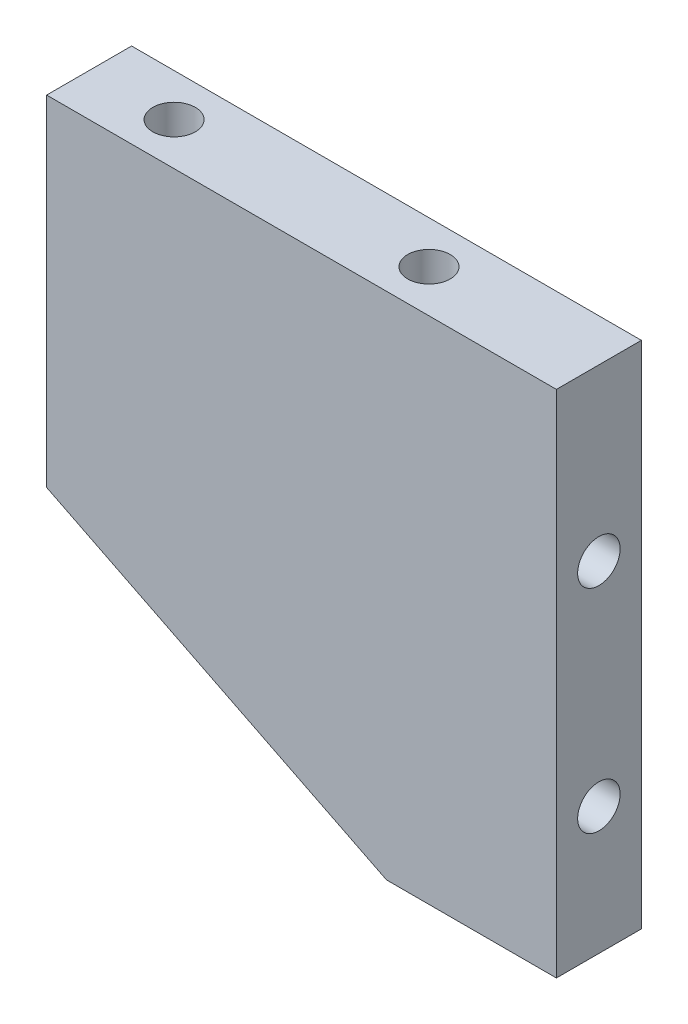
ISO-10303-21;
HEADER;
FILE_DESCRIPTION(('STEP AP214'),'2;1');
FILE_NAME('part.step','',(''),(''),'','','');
FILE_SCHEMA(('AUTOMOTIVE_DESIGN { 1 0 10303 214 1 1 1 1 }'));
ENDSEC;
DATA;
#1=APPLICATION_CONTEXT('core data for automotive mechanical design processes');
#2=APPLICATION_PROTOCOL_DEFINITION('international standard','automotive_design',2000,#1);
#3=PRODUCT_CONTEXT('',#1,'mechanical');
#4=PRODUCT('Part','Part','',(#3));
#5=PRODUCT_RELATED_PRODUCT_CATEGORY('part','',(#4));
#6=PRODUCT_DEFINITION_FORMATION('','',#4);
#7=PRODUCT_DEFINITION_CONTEXT('part definition',#1,'design');
#8=PRODUCT_DEFINITION('design','',#6,#7);
#9=PRODUCT_DEFINITION_SHAPE('','',#8);
#10=(LENGTH_UNIT() NAMED_UNIT(*) SI_UNIT(.MILLI.,.METRE.));
#11=(NAMED_UNIT(*) PLANE_ANGLE_UNIT() SI_UNIT($,.RADIAN.));
#12=(NAMED_UNIT(*) SI_UNIT($,.STERADIAN.) SOLID_ANGLE_UNIT());
#13=UNCERTAINTY_MEASURE_WITH_UNIT(LENGTH_MEASURE(1.E-05),#10,'distance_accuracy_value','');
#14=(GEOMETRIC_REPRESENTATION_CONTEXT(3) GLOBAL_UNCERTAINTY_ASSIGNED_CONTEXT((#13)) GLOBAL_UNIT_ASSIGNED_CONTEXT((#10,
#11,#12)) REPRESENTATION_CONTEXT('',''));
#15=CARTESIAN_POINT('',(0.,0.,0.));
#16=DIRECTION('',(0.,0.,1.));
#17=DIRECTION('',(1.,0.,0.));
#18=AXIS2_PLACEMENT_3D('',#15,#16,#17);
#19=CARTESIAN_POINT('',(0.,-60.,5.));
#20=DIRECTION('',(-1.,0.,0.));
#21=DIRECTION('',(0.,0.,1.));
#22=AXIS2_PLACEMENT_3D('',#19,#20,#21);
#23=PLANE('',#22);
#24=CARTESIAN_POINT('',(0.,-20.,0.));
#25=DIRECTION('',(1.,0.,0.));
#26=DIRECTION('',(0.,0.,-1.));
#27=AXIS2_PLACEMENT_3D('',#24,#25,#26);
#28=CIRCLE('',#27,2.49999999999999);
#29=CARTESIAN_POINT('',(0.,-20.,-2.49999999999999));
#30=VERTEX_POINT('',#29);
#31=EDGE_CURVE('E152',#30,#30,#28,.T.);
#32=ORIENTED_EDGE('',*,*,#31,.F.);
#33=EDGE_LOOP('',(#32));
#34=FACE_BOUND('',#33,.T.);
#35=CARTESIAN_POINT('',(0.,-45.,0.));
#36=DIRECTION('',(1.,0.,0.));
#37=DIRECTION('',(0.,0.,-1.));
#38=AXIS2_PLACEMENT_3D('',#35,#36,#37);
#39=CIRCLE('',#38,2.49999999999999);
#40=CARTESIAN_POINT('',(0.,-45.,-2.49999999999999));
#41=VERTEX_POINT('',#40);
#42=EDGE_CURVE('E155',#41,#41,#39,.T.);
#43=ORIENTED_EDGE('',*,*,#42,.F.);
#44=EDGE_LOOP('',(#43));
#45=FACE_BOUND('',#44,.T.);
#46=DIRECTION('',(0.,1.,0.));
#47=VECTOR('',#46,1.);
#48=CARTESIAN_POINT('',(0.,-60.,-5.));
#49=LINE('',#48,#47);
#50=CARTESIAN_POINT('',(0.,-60.,-5.));
#51=VERTEX_POINT('',#50);
#52=CARTESIAN_POINT('',(0.,0.,-5.));
#53=VERTEX_POINT('',#52);
#54=EDGE_CURVE('E115',#51,#53,#49,.T.);
#55=ORIENTED_EDGE('',*,*,#54,.T.);
#56=DIRECTION('',(0.,0.,-1.));
#57=VECTOR('',#56,1.);
#58=CARTESIAN_POINT('',(0.,0.,5.));
#59=LINE('',#58,#57);
#60=CARTESIAN_POINT('',(0.,0.,5.));
#61=VERTEX_POINT('',#60);
#62=EDGE_CURVE('E11',#61,#53,#59,.T.);
#63=ORIENTED_EDGE('',*,*,#62,.F.);
#64=DIRECTION('',(0.,1.,0.));
#65=VECTOR('',#64,1.);
#66=CARTESIAN_POINT('',(0.,-60.,5.));
#67=LINE('',#66,#65);
#68=CARTESIAN_POINT('',(0.,-60.,5.));
#69=VERTEX_POINT('',#68);
#70=EDGE_CURVE('E124',#69,#61,#67,.T.);
#71=ORIENTED_EDGE('',*,*,#70,.F.);
#72=DIRECTION('',(0.,0.,-1.));
#73=VECTOR('',#72,1.);
#74=CARTESIAN_POINT('',(0.,-60.,5.));
#75=LINE('',#74,#73);
#76=EDGE_CURVE('E111',#69,#51,#75,.T.);
#77=ORIENTED_EDGE('',*,*,#76,.T.);
#78=EDGE_LOOP('',(#55,#63,#71,#77));
#79=FACE_BOUND('',#78,.T.);
#80=ADVANCED_FACE('F38',(#34,#45,#79),#23,.F.);
#81=CARTESIAN_POINT('',(0.,0.,5.));
#82=DIRECTION('',(0.,-1.,0.));
#83=DIRECTION('',(1.,0.,0.));
#84=AXIS2_PLACEMENT_3D('',#81,#82,#83);
#85=PLANE('',#84);
#86=CARTESIAN_POINT('',(-20.,0.,0.));
#87=DIRECTION('',(0.,1.,0.));
#88=DIRECTION('',(0.,0.,1.));
#89=AXIS2_PLACEMENT_3D('',#86,#87,#88);
#90=CIRCLE('',#89,2.49999999999999);
#91=CARTESIAN_POINT('',(-20.,0.,2.49999999999999));
#92=VERTEX_POINT('',#91);
#93=EDGE_CURVE('E175',#92,#92,#90,.T.);
#94=ORIENTED_EDGE('',*,*,#93,.F.);
#95=EDGE_LOOP('',(#94));
#96=FACE_BOUND('',#95,.T.);
#97=CARTESIAN_POINT('',(-50.,0.,0.));
#98=DIRECTION('',(0.,1.,0.));
#99=DIRECTION('',(0.,0.,1.));
#100=AXIS2_PLACEMENT_3D('',#97,#98,#99);
#101=CIRCLE('',#100,2.49999999999999);
#102=CARTESIAN_POINT('',(-50.,0.,2.49999999999999));
#103=VERTEX_POINT('',#102);
#104=EDGE_CURVE('E169',#103,#103,#101,.T.);
#105=ORIENTED_EDGE('',*,*,#104,.F.);
#106=EDGE_LOOP('',(#105));
#107=FACE_BOUND('',#106,.T.);
#108=DIRECTION('',(-1.,0.,0.));
#109=VECTOR('',#108,1.);
#110=CARTESIAN_POINT('',(0.,0.,-5.));
#111=LINE('',#110,#109);
#112=CARTESIAN_POINT('',(-60.,0.,-5.));
#113=VERTEX_POINT('',#112);
#114=EDGE_CURVE('E118',#53,#113,#111,.T.);
#115=ORIENTED_EDGE('',*,*,#114,.T.);
#116=DIRECTION('',(0.,0.,-1.));
#117=VECTOR('',#116,1.);
#118=CARTESIAN_POINT('',(-60.,0.,5.));
#119=LINE('',#118,#117);
#120=CARTESIAN_POINT('',(-60.,0.,5.));
#121=VERTEX_POINT('',#120);
#122=EDGE_CURVE('E46',#121,#113,#119,.T.);
#123=ORIENTED_EDGE('',*,*,#122,.F.);
#124=DIRECTION('',(-1.,0.,0.));
#125=VECTOR('',#124,1.);
#126=CARTESIAN_POINT('',(0.,0.,5.));
#127=LINE('',#126,#125);
#128=EDGE_CURVE('E89',#61,#121,#127,.T.);
#129=ORIENTED_EDGE('',*,*,#128,.F.);
#130=ORIENTED_EDGE('',*,*,#62,.T.);
#131=EDGE_LOOP('',(#115,#123,#129,#130));
#132=FACE_BOUND('',#131,.T.);
#133=ADVANCED_FACE('F143',(#96,#107,#132),#85,.F.);
#134=CARTESIAN_POINT('',(-60.,0.,5.));
#135=DIRECTION('',(1.,0.,0.));
#136=DIRECTION('',(0.,1.,0.));
#137=AXIS2_PLACEMENT_3D('',#134,#135,#136);
#138=PLANE('',#137);
#139=DIRECTION('',(0.,-1.,0.));
#140=VECTOR('',#139,1.);
#141=CARTESIAN_POINT('',(-60.,0.,-5.));
#142=LINE('',#141,#140);
#143=CARTESIAN_POINT('',(-60.,-40.,-5.));
#144=VERTEX_POINT('',#143);
#145=EDGE_CURVE('E106',#113,#144,#142,.T.);
#146=ORIENTED_EDGE('',*,*,#145,.T.);
#147=DIRECTION('',(0.,0.,-1.));
#148=VECTOR('',#147,1.);
#149=CARTESIAN_POINT('',(-60.,-40.,5.));
#150=LINE('',#149,#148);
#151=CARTESIAN_POINT('',(-60.,-40.,5.));
#152=VERTEX_POINT('',#151);
#153=EDGE_CURVE('E103',#152,#144,#150,.T.);
#154=ORIENTED_EDGE('',*,*,#153,.F.);
#155=DIRECTION('',(0.,-1.,0.));
#156=VECTOR('',#155,1.);
#157=CARTESIAN_POINT('',(-60.,0.,5.));
#158=LINE('',#157,#156);
#159=EDGE_CURVE('E95',#121,#152,#158,.T.);
#160=ORIENTED_EDGE('',*,*,#159,.F.);
#161=ORIENTED_EDGE('',*,*,#122,.T.);
#162=EDGE_LOOP('',(#146,#154,#160,#161));
#163=FACE_BOUND('',#162,.T.);
#164=ADVANCED_FACE('F104',(#163),#138,.F.);
#165=CARTESIAN_POINT('',(-60.,-40.,5.));
#166=DIRECTION('',(0.447213595499958,0.894427190999916,0.));
#167=DIRECTION('',(-0.894427190999916,0.447213595499958,0.));
#168=AXIS2_PLACEMENT_3D('',#165,#166,#167);
#169=PLANE('',#168);
#170=DIRECTION('',(0.894427190999916,-0.447213595499958,0.));
#171=VECTOR('',#170,1.);
#172=CARTESIAN_POINT('',(-60.,-40.,-5.));
#173=LINE('',#172,#171);
#174=CARTESIAN_POINT('',(-20.,-60.,-5.));
#175=VERTEX_POINT('',#174);
#176=EDGE_CURVE('E75',#144,#175,#173,.T.);
#177=ORIENTED_EDGE('',*,*,#176,.T.);
#178=DIRECTION('',(0.,0.,-1.));
#179=VECTOR('',#178,1.);
#180=CARTESIAN_POINT('',(-20.,-60.,5.));
#181=LINE('',#180,#179);
#182=CARTESIAN_POINT('',(-20.,-60.,5.));
#183=VERTEX_POINT('',#182);
#184=EDGE_CURVE('E107',#183,#175,#181,.T.);
#185=ORIENTED_EDGE('',*,*,#184,.F.);
#186=DIRECTION('',(0.894427190999916,-0.447213595499958,0.));
#187=VECTOR('',#186,1.);
#188=CARTESIAN_POINT('',(-60.,-40.,5.));
#189=LINE('',#188,#187);
#190=EDGE_CURVE('E99',#152,#183,#189,.T.);
#191=ORIENTED_EDGE('',*,*,#190,.F.);
#192=ORIENTED_EDGE('',*,*,#153,.T.);
#193=EDGE_LOOP('',(#177,#185,#191,#192));
#194=FACE_BOUND('',#193,.T.);
#195=ADVANCED_FACE('F109',(#194),#169,.F.);
#196=CARTESIAN_POINT('',(-20.,-60.,5.));
#197=DIRECTION('',(0.,1.,0.));
#198=DIRECTION('',(0.,0.,1.));
#199=AXIS2_PLACEMENT_3D('',#196,#197,#198);
#200=PLANE('',#199);
#201=DIRECTION('',(1.,0.,0.));
#202=VECTOR('',#201,1.);
#203=CARTESIAN_POINT('',(-20.,-60.,-5.));
#204=LINE('',#203,#202);
#205=EDGE_CURVE('E81',#175,#51,#204,.T.);
#206=ORIENTED_EDGE('',*,*,#205,.T.);
#207=ORIENTED_EDGE('',*,*,#76,.F.);
#208=DIRECTION('',(1.,0.,0.));
#209=VECTOR('',#208,1.);
#210=CARTESIAN_POINT('',(-20.,-60.,5.));
#211=LINE('',#210,#209);
#212=EDGE_CURVE('E54',#183,#69,#211,.T.);
#213=ORIENTED_EDGE('',*,*,#212,.F.);
#214=ORIENTED_EDGE('',*,*,#184,.T.);
#215=EDGE_LOOP('',(#206,#207,#213,#214));
#216=FACE_BOUND('',#215,.T.);
#217=ADVANCED_FACE('F132',(#216),#200,.F.);
#218=CARTESIAN_POINT('',(0.,0.,5.));
#219=DIRECTION('',(0.,0.,1.));
#220=DIRECTION('',(1.,0.,0.));
#221=AXIS2_PLACEMENT_3D('',#218,#219,#220);
#222=PLANE('',#221);
#223=ORIENTED_EDGE('',*,*,#70,.T.);
#224=ORIENTED_EDGE('',*,*,#128,.T.);
#225=ORIENTED_EDGE('',*,*,#159,.T.);
#226=ORIENTED_EDGE('',*,*,#190,.T.);
#227=ORIENTED_EDGE('',*,*,#212,.T.);
#228=EDGE_LOOP('',(#223,#224,#225,#226,#227));
#229=FACE_BOUND('',#228,.T.);
#230=ADVANCED_FACE('F97',(#229),#222,.T.);
#231=CARTESIAN_POINT('',(0.,0.,-5.));
#232=DIRECTION('',(0.,0.,1.));
#233=DIRECTION('',(1.,0.,0.));
#234=AXIS2_PLACEMENT_3D('',#231,#232,#233);
#235=PLANE('',#234);
#236=ORIENTED_EDGE('',*,*,#54,.F.);
#237=ORIENTED_EDGE('',*,*,#205,.F.);
#238=ORIENTED_EDGE('',*,*,#176,.F.);
#239=ORIENTED_EDGE('',*,*,#145,.F.);
#240=ORIENTED_EDGE('',*,*,#114,.F.);
#241=EDGE_LOOP('',(#236,#237,#238,#239,#240));
#242=FACE_BOUND('',#241,.T.);
#243=ADVANCED_FACE('F128',(#242),#235,.F.);
#244=CARTESIAN_POINT('',(-15.,-45.,0.));
#245=DIRECTION('',(1.,0.,0.));
#246=DIRECTION('',(0.,0.,-1.));
#247=AXIS2_PLACEMENT_3D('',#244,#245,#246);
#248=CONICAL_SURFACE('',#247,2.49999999999999,1.02974425867665);
#249=CARTESIAN_POINT('',(-16.5021515475689,-45.,0.));
#250=VERTEX_POINT('',#249);
#251=VERTEX_LOOP('',#250);
#252=FACE_BOUND('',#251,.T.);
#253=CARTESIAN_POINT('',(-15.,-45.,0.));
#254=DIRECTION('',(1.,0.,0.));
#255=DIRECTION('',(0.,0.,-1.));
#256=AXIS2_PLACEMENT_3D('',#253,#254,#255);
#257=CIRCLE('',#256,2.49999999999999);
#258=CARTESIAN_POINT('',(-15.,-45.,-2.49999999999999));
#259=VERTEX_POINT('',#258);
#260=EDGE_CURVE('E119',#259,#259,#257,.T.);
#261=ORIENTED_EDGE('',*,*,#260,.T.);
#262=EDGE_LOOP('',(#261));
#263=FACE_BOUND('',#262,.T.);
#264=ADVANCED_FACE('F211',(#252,#263),#248,.F.);
#265=CARTESIAN_POINT('',(0.,-45.,0.));
#266=DIRECTION('',(1.,0.,0.));
#267=DIRECTION('',(0.,0.,-1.));
#268=AXIS2_PLACEMENT_3D('',#265,#266,#267);
#269=CYLINDRICAL_SURFACE('',#268,2.49999999999999);
#270=ORIENTED_EDGE('',*,*,#260,.F.);
#271=EDGE_LOOP('',(#270));
#272=FACE_BOUND('',#271,.T.);
#273=ORIENTED_EDGE('',*,*,#42,.T.);
#274=EDGE_LOOP('',(#273));
#275=FACE_BOUND('',#274,.T.);
#276=ADVANCED_FACE('F207',(#272,#275),#269,.F.);
#277=CARTESIAN_POINT('',(-15.,-20.,0.));
#278=DIRECTION('',(1.,0.,0.));
#279=DIRECTION('',(0.,0.,-1.));
#280=AXIS2_PLACEMENT_3D('',#277,#278,#279);
#281=CONICAL_SURFACE('',#280,2.49999999999999,1.02974425867665);
#282=CARTESIAN_POINT('',(-16.5021515475689,-20.,0.));
#283=VERTEX_POINT('',#282);
#284=VERTEX_LOOP('',#283);
#285=FACE_BOUND('',#284,.T.);
#286=CARTESIAN_POINT('',(-15.,-20.,0.));
#287=DIRECTION('',(1.,0.,0.));
#288=DIRECTION('',(0.,0.,-1.));
#289=AXIS2_PLACEMENT_3D('',#286,#287,#288);
#290=CIRCLE('',#289,2.49999999999999);
#291=CARTESIAN_POINT('',(-15.,-20.,-2.49999999999999));
#292=VERTEX_POINT('',#291);
#293=EDGE_CURVE('E157',#292,#292,#290,.T.);
#294=ORIENTED_EDGE('',*,*,#293,.T.);
#295=EDGE_LOOP('',(#294));
#296=FACE_BOUND('',#295,.T.);
#297=ADVANCED_FACE('F203',(#285,#296),#281,.F.);
#298=CARTESIAN_POINT('',(0.,-20.,0.));
#299=DIRECTION('',(1.,0.,0.));
#300=DIRECTION('',(0.,0.,-1.));
#301=AXIS2_PLACEMENT_3D('',#298,#299,#300);
#302=CYLINDRICAL_SURFACE('',#301,2.49999999999999);
#303=ORIENTED_EDGE('',*,*,#293,.F.);
#304=EDGE_LOOP('',(#303));
#305=FACE_BOUND('',#304,.T.);
#306=ORIENTED_EDGE('',*,*,#31,.T.);
#307=EDGE_LOOP('',(#306));
#308=FACE_BOUND('',#307,.T.);
#309=ADVANCED_FACE('F195',(#305,#308),#302,.F.);
#310=CARTESIAN_POINT('',(-50.,-15.,0.));
#311=DIRECTION('',(0.,1.,0.));
#312=DIRECTION('',(0.,0.,1.));
#313=AXIS2_PLACEMENT_3D('',#310,#311,#312);
#314=CONICAL_SURFACE('',#313,2.49999999999999,1.02974425867665);
#315=CARTESIAN_POINT('',(-50.,-16.5021515475689,0.));
#316=VERTEX_POINT('',#315);
#317=VERTEX_LOOP('',#316);
#318=FACE_BOUND('',#317,.T.);
#319=CARTESIAN_POINT('',(-50.,-15.,0.));
#320=DIRECTION('',(0.,1.,0.));
#321=DIRECTION('',(0.,0.,1.));
#322=AXIS2_PLACEMENT_3D('',#319,#320,#321);
#323=CIRCLE('',#322,2.49999999999999);
#324=CARTESIAN_POINT('',(-50.,-15.,2.49999999999999));
#325=VERTEX_POINT('',#324);
#326=EDGE_CURVE('E166',#325,#325,#323,.T.);
#327=ORIENTED_EDGE('',*,*,#326,.T.);
#328=EDGE_LOOP('',(#327));
#329=FACE_BOUND('',#328,.T.);
#330=ADVANCED_FACE('F186',(#318,#329),#314,.F.);
#331=CARTESIAN_POINT('',(-50.,0.,0.));
#332=DIRECTION('',(0.,1.,0.));
#333=DIRECTION('',(0.,0.,1.));
#334=AXIS2_PLACEMENT_3D('',#331,#332,#333);
#335=CYLINDRICAL_SURFACE('',#334,2.49999999999999);
#336=ORIENTED_EDGE('',*,*,#326,.F.);
#337=EDGE_LOOP('',(#336));
#338=FACE_BOUND('',#337,.T.);
#339=ORIENTED_EDGE('',*,*,#104,.T.);
#340=EDGE_LOOP('',(#339));
#341=FACE_BOUND('',#340,.T.);
#342=ADVANCED_FACE('F183',(#338,#341),#335,.F.);
#343=CARTESIAN_POINT('',(-20.,-15.,0.));
#344=DIRECTION('',(0.,1.,0.));
#345=DIRECTION('',(0.,0.,1.));
#346=AXIS2_PLACEMENT_3D('',#343,#344,#345);
#347=CONICAL_SURFACE('',#346,2.49999999999999,1.02974425867665);
#348=CARTESIAN_POINT('',(-20.,-16.5021515475689,0.));
#349=VERTEX_POINT('',#348);
#350=VERTEX_LOOP('',#349);
#351=FACE_BOUND('',#350,.T.);
#352=CARTESIAN_POINT('',(-20.,-15.,0.));
#353=DIRECTION('',(0.,1.,0.));
#354=DIRECTION('',(0.,0.,1.));
#355=AXIS2_PLACEMENT_3D('',#352,#353,#354);
#356=CIRCLE('',#355,2.49999999999999);
#357=CARTESIAN_POINT('',(-20.,-15.,2.49999999999999));
#358=VERTEX_POINT('',#357);
#359=EDGE_CURVE('E172',#358,#358,#356,.T.);
#360=ORIENTED_EDGE('',*,*,#359,.T.);
#361=EDGE_LOOP('',(#360));
#362=FACE_BOUND('',#361,.T.);
#363=ADVANCED_FACE('F185',(#351,#362),#347,.F.);
#364=CARTESIAN_POINT('',(-20.,0.,0.));
#365=DIRECTION('',(0.,1.,0.));
#366=DIRECTION('',(0.,0.,1.));
#367=AXIS2_PLACEMENT_3D('',#364,#365,#366);
#368=CYLINDRICAL_SURFACE('',#367,2.49999999999999);
#369=ORIENTED_EDGE('',*,*,#359,.F.);
#370=EDGE_LOOP('',(#369));
#371=FACE_BOUND('',#370,.T.);
#372=ORIENTED_EDGE('',*,*,#93,.T.);
#373=EDGE_LOOP('',(#372));
#374=FACE_BOUND('',#373,.T.);
#375=ADVANCED_FACE('F179',(#371,#374),#368,.F.);
#376=CLOSED_SHELL('',(#80,#133,#164,#195,#217,#230,#243,#264,#276,#297,#309,#330,#342,#363,#375));
#377=MANIFOLD_SOLID_BREP('B2',#376);
#378=ADVANCED_BREP_SHAPE_REPRESENTATION('',(#18,#377),#14);
#379=SHAPE_DEFINITION_REPRESENTATION(#9,#378);
ENDSEC;
END-ISO-10303-21;
